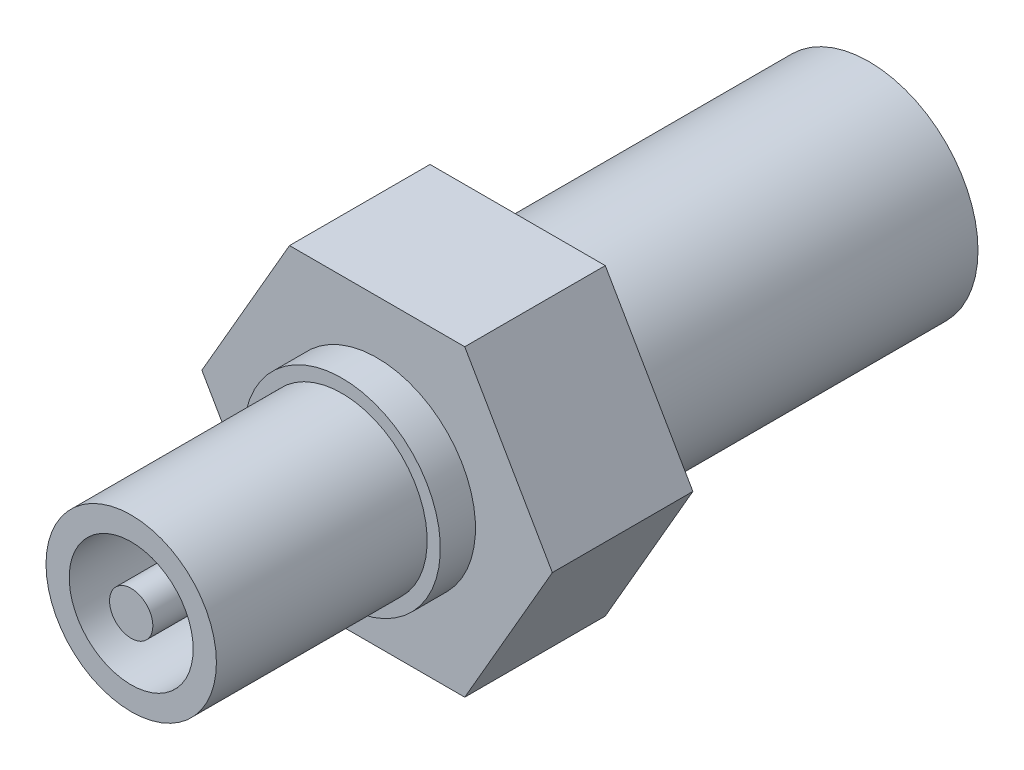
ISO-10303-21;
HEADER;
FILE_DESCRIPTION(('STEP AP214'),'2;1');
FILE_NAME('part.step','',(''),(''),'','','');
FILE_SCHEMA(('AUTOMOTIVE_DESIGN { 1 0 10303 214 1 1 1 1 }'));
ENDSEC;
DATA;
#1=APPLICATION_CONTEXT('core data for automotive mechanical design processes');
#2=APPLICATION_PROTOCOL_DEFINITION('international standard','automotive_design',2000,#1);
#3=PRODUCT_CONTEXT('',#1,'mechanical');
#4=PRODUCT('Part','Part','',(#3));
#5=PRODUCT_RELATED_PRODUCT_CATEGORY('part','',(#4));
#6=PRODUCT_DEFINITION_FORMATION('','',#4);
#7=PRODUCT_DEFINITION_CONTEXT('part definition',#1,'design');
#8=PRODUCT_DEFINITION('design','',#6,#7);
#9=PRODUCT_DEFINITION_SHAPE('','',#8);
#10=(LENGTH_UNIT() NAMED_UNIT(*) SI_UNIT(.MILLI.,.METRE.));
#11=(NAMED_UNIT(*) PLANE_ANGLE_UNIT() SI_UNIT($,.RADIAN.));
#12=(NAMED_UNIT(*) SI_UNIT($,.STERADIAN.) SOLID_ANGLE_UNIT());
#13=UNCERTAINTY_MEASURE_WITH_UNIT(LENGTH_MEASURE(1.E-05),#10,'distance_accuracy_value','');
#14=(GEOMETRIC_REPRESENTATION_CONTEXT(3) GLOBAL_UNCERTAINTY_ASSIGNED_CONTEXT((#13)) GLOBAL_UNIT_ASSIGNED_CONTEXT((#10,
#11,#12)) REPRESENTATION_CONTEXT('',''));
#15=CARTESIAN_POINT('',(0.,0.,0.));
#16=DIRECTION('',(0.,0.,1.));
#17=DIRECTION('',(1.,0.,0.));
#18=AXIS2_PLACEMENT_3D('',#15,#16,#17);
#19=CARTESIAN_POINT('',(3.95946814610245,6.858,-7.9375));
#20=DIRECTION('',(0.,0.,1.));
#21=DIRECTION('',(1.,0.,0.));
#22=AXIS2_PLACEMENT_3D('',#19,#20,#21);
#23=PLANE('',#22);
#24=DIRECTION('',(0.5,-0.866025403784439,0.));
#25=VECTOR('',#24,1.);
#26=CARTESIAN_POINT('',(7.91893629220491,0.,-7.9375));
#27=LINE('',#26,#25);
#28=CARTESIAN_POINT('',(3.95946814610245,6.858,-7.9375));
#29=VERTEX_POINT('',#28);
#30=CARTESIAN_POINT('',(7.91893629220491,0.,-7.9375));
#31=VERTEX_POINT('',#30);
#32=EDGE_CURVE('E128',#29,#31,#27,.T.);
#33=ORIENTED_EDGE('',*,*,#32,.T.);
#34=DIRECTION('',(-0.5,-0.866025403784439,0.));
#35=VECTOR('',#34,1.);
#36=CARTESIAN_POINT('',(3.95946814610245,-6.858,-7.9375));
#37=LINE('',#36,#35);
#38=CARTESIAN_POINT('',(3.95946814610245,-6.858,-7.9375));
#39=VERTEX_POINT('',#38);
#40=EDGE_CURVE('E105',#31,#39,#37,.T.);
#41=ORIENTED_EDGE('',*,*,#40,.T.);
#42=DIRECTION('',(-1.,0.,0.));
#43=VECTOR('',#42,1.);
#44=CARTESIAN_POINT('',(-3.95946814610245,-6.858,-7.9375));
#45=LINE('',#44,#43);
#46=CARTESIAN_POINT('',(-3.95946814610245,-6.858,-7.9375));
#47=VERTEX_POINT('',#46);
#48=EDGE_CURVE('E131',#39,#47,#45,.T.);
#49=ORIENTED_EDGE('',*,*,#48,.T.);
#50=DIRECTION('',(-0.5,0.866025403784439,0.));
#51=VECTOR('',#50,1.);
#52=CARTESIAN_POINT('',(-7.91893629220491,0.,-7.9375));
#53=LINE('',#52,#51);
#54=CARTESIAN_POINT('',(-7.91893629220491,0.,-7.9375));
#55=VERTEX_POINT('',#54);
#56=EDGE_CURVE('E133',#47,#55,#53,.T.);
#57=ORIENTED_EDGE('',*,*,#56,.T.);
#58=DIRECTION('',(0.5,0.866025403784439,0.));
#59=VECTOR('',#58,1.);
#60=CARTESIAN_POINT('',(-3.95946814610246,6.858,-7.9375));
#61=LINE('',#60,#59);
#62=CARTESIAN_POINT('',(-3.95946814610246,6.858,-7.9375));
#63=VERTEX_POINT('',#62);
#64=EDGE_CURVE('E56',#55,#63,#61,.T.);
#65=ORIENTED_EDGE('',*,*,#64,.T.);
#66=DIRECTION('',(1.,0.,0.));
#67=VECTOR('',#66,1.);
#68=CARTESIAN_POINT('',(3.95946814610245,6.858,-7.9375));
#69=LINE('',#68,#67);
#70=EDGE_CURVE('E51',#63,#29,#69,.T.);
#71=ORIENTED_EDGE('',*,*,#70,.T.);
#72=EDGE_LOOP('',(#33,#41,#49,#57,#65,#71));
#73=FACE_BOUND('',#72,.T.);
#74=CARTESIAN_POINT('',(0.,0.,-7.9375));
#75=DIRECTION('',(0.,0.,1.));
#76=DIRECTION('',(1.,0.,0.));
#77=AXIS2_PLACEMENT_3D('',#74,#75,#76);
#78=CIRCLE('',#77,4.9276);
#79=CARTESIAN_POINT('',(4.9276,0.,-7.9375));
#80=VERTEX_POINT('',#79);
#81=EDGE_CURVE('E11',#80,#80,#78,.F.);
#82=ORIENTED_EDGE('',*,*,#81,.F.);
#83=EDGE_LOOP('',(#82));
#84=FACE_BOUND('',#83,.T.);
#85=ADVANCED_FACE('F36',(#73,#84),#23,.F.);
#86=CARTESIAN_POINT('',(0.,0.,9.525));
#87=DIRECTION('',(0.,0.,-1.));
#88=DIRECTION('',(-1.,0.,0.));
#89=AXIS2_PLACEMENT_3D('',#86,#87,#88);
#90=CYLINDRICAL_SURFACE('',#89,3.85);
#91=CARTESIAN_POINT('',(0.,0.,9.525));
#92=DIRECTION('',(0.,0.,1.));
#93=DIRECTION('',(1.,0.,0.));
#94=AXIS2_PLACEMENT_3D('',#91,#92,#93);
#95=CIRCLE('',#94,3.85);
#96=CARTESIAN_POINT('',(3.85,0.,9.525));
#97=VERTEX_POINT('',#96);
#98=EDGE_CURVE('E44',#97,#97,#95,.T.);
#99=ORIENTED_EDGE('',*,*,#98,.F.);
#100=EDGE_LOOP('',(#99));
#101=FACE_BOUND('',#100,.T.);
#102=CARTESIAN_POINT('',(0.,0.,0.));
#103=DIRECTION('',(0.,0.,-1.));
#104=DIRECTION('',(-1.,0.,0.));
#105=AXIS2_PLACEMENT_3D('',#102,#103,#104);
#106=CIRCLE('',#105,3.85);
#107=CARTESIAN_POINT('',(-3.85,0.,0.));
#108=VERTEX_POINT('',#107);
#109=EDGE_CURVE('E153',#108,#108,#106,.T.);
#110=ORIENTED_EDGE('',*,*,#109,.F.);
#111=EDGE_LOOP('',(#110));
#112=FACE_BOUND('',#111,.T.);
#113=ADVANCED_FACE('F38',(#101,#112),#90,.T.);
#114=CARTESIAN_POINT('',(0.,0.,9.525));
#115=DIRECTION('',(0.,0.,1.));
#116=DIRECTION('',(1.,0.,0.));
#117=AXIS2_PLACEMENT_3D('',#114,#115,#116);
#118=PLANE('',#117);
#119=CARTESIAN_POINT('',(0.,0.,9.525));
#120=DIRECTION('',(0.,0.,1.));
#121=DIRECTION('',(1.,0.,0.));
#122=AXIS2_PLACEMENT_3D('',#119,#120,#121);
#123=CIRCLE('',#122,2.80042077962707);
#124=CARTESIAN_POINT('',(2.80042077962707,0.,9.525));
#125=VERTEX_POINT('',#124);
#126=EDGE_CURVE('E341',#125,#125,#123,.T.);
#127=ORIENTED_EDGE('',*,*,#126,.F.);
#128=EDGE_LOOP('',(#127));
#129=FACE_BOUND('',#128,.T.);
#130=ORIENTED_EDGE('',*,*,#98,.T.);
#131=EDGE_LOOP('',(#130));
#132=FACE_BOUND('',#131,.T.);
#133=ADVANCED_FACE('F158',(#129,#132),#118,.T.);
#134=CARTESIAN_POINT('',(0.,0.,0.));
#135=DIRECTION('',(0.,0.,-1.));
#136=DIRECTION('',(-1.,0.,0.));
#137=AXIS2_PLACEMENT_3D('',#134,#135,#136);
#138=PLANE('',#137);
#139=CARTESIAN_POINT('',(0.,0.,0.));
#140=DIRECTION('',(0.,0.,-1.));
#141=DIRECTION('',(-1.,0.,0.));
#142=AXIS2_PLACEMENT_3D('',#139,#140,#141);
#143=CIRCLE('',#142,4.445);
#144=CARTESIAN_POINT('',(-4.445,0.,0.));
#145=VERTEX_POINT('',#144);
#146=EDGE_CURVE('E108',#145,#145,#143,.T.);
#147=ORIENTED_EDGE('',*,*,#146,.F.);
#148=EDGE_LOOP('',(#147));
#149=FACE_BOUND('',#148,.T.);
#150=ORIENTED_EDGE('',*,*,#109,.T.);
#151=EDGE_LOOP('',(#150));
#152=FACE_BOUND('',#151,.T.);
#153=ADVANCED_FACE('F164',(#149,#152),#138,.F.);
#154=CARTESIAN_POINT('',(0.,0.,-1.5875));
#155=DIRECTION('',(0.,0.,1.));
#156=DIRECTION('',(1.,0.,0.));
#157=AXIS2_PLACEMENT_3D('',#154,#155,#156);
#158=CYLINDRICAL_SURFACE('',#157,4.445);
#159=CARTESIAN_POINT('',(0.,0.,-1.5875));
#160=DIRECTION('',(0.,0.,-1.));
#161=DIRECTION('',(-1.,0.,0.));
#162=AXIS2_PLACEMENT_3D('',#159,#160,#161);
#163=CIRCLE('',#162,4.445);
#164=CARTESIAN_POINT('',(-4.445,0.,-1.5875));
#165=VERTEX_POINT('',#164);
#166=EDGE_CURVE('E150',#165,#165,#163,.T.);
#167=ORIENTED_EDGE('',*,*,#166,.F.);
#168=EDGE_LOOP('',(#167));
#169=FACE_BOUND('',#168,.T.);
#170=ORIENTED_EDGE('',*,*,#146,.T.);
#171=EDGE_LOOP('',(#170));
#172=FACE_BOUND('',#171,.T.);
#173=ADVANCED_FACE('F166',(#169,#172),#158,.T.);
#174=CARTESIAN_POINT('',(3.95946814610245,6.858,-1.5875));
#175=DIRECTION('',(0.,0.,1.));
#176=DIRECTION('',(1.,0.,0.));
#177=AXIS2_PLACEMENT_3D('',#174,#175,#176);
#178=PLANE('',#177);
#179=DIRECTION('',(0.5,-0.866025403784439,0.));
#180=VECTOR('',#179,1.);
#181=CARTESIAN_POINT('',(7.91893629220491,0.,-1.5875));
#182=LINE('',#181,#180);
#183=CARTESIAN_POINT('',(3.95946814610245,6.858,-1.5875));
#184=VERTEX_POINT('',#183);
#185=CARTESIAN_POINT('',(7.91893629220491,0.,-1.5875));
#186=VERTEX_POINT('',#185);
#187=EDGE_CURVE('E95',#184,#186,#182,.T.);
#188=ORIENTED_EDGE('',*,*,#187,.F.);
#189=DIRECTION('',(1.,0.,0.));
#190=VECTOR('',#189,1.);
#191=CARTESIAN_POINT('',(3.95946814610245,6.858,-1.5875));
#192=LINE('',#191,#190);
#193=CARTESIAN_POINT('',(-3.95946814610246,6.858,-1.5875));
#194=VERTEX_POINT('',#193);
#195=EDGE_CURVE('E126',#194,#184,#192,.T.);
#196=ORIENTED_EDGE('',*,*,#195,.F.);
#197=DIRECTION('',(0.5,0.866025403784439,0.));
#198=VECTOR('',#197,1.);
#199=CARTESIAN_POINT('',(-3.95946814610246,6.858,-1.5875));
#200=LINE('',#199,#198);
#201=CARTESIAN_POINT('',(-7.91893629220491,0.,-1.5875));
#202=VERTEX_POINT('',#201);
#203=EDGE_CURVE('E124',#202,#194,#200,.T.);
#204=ORIENTED_EDGE('',*,*,#203,.F.);
#205=DIRECTION('',(-0.5,0.866025403784439,0.));
#206=VECTOR('',#205,1.);
#207=CARTESIAN_POINT('',(-7.91893629220491,0.,-1.5875));
#208=LINE('',#207,#206);
#209=CARTESIAN_POINT('',(-3.95946814610245,-6.858,-1.5875));
#210=VERTEX_POINT('',#209);
#211=EDGE_CURVE('E122',#210,#202,#208,.T.);
#212=ORIENTED_EDGE('',*,*,#211,.F.);
#213=DIRECTION('',(-1.,0.,0.));
#214=VECTOR('',#213,1.);
#215=CARTESIAN_POINT('',(-3.95946814610245,-6.858,-1.5875));
#216=LINE('',#215,#214);
#217=CARTESIAN_POINT('',(3.95946814610245,-6.858,-1.5875));
#218=VERTEX_POINT('',#217);
#219=EDGE_CURVE('E97',#218,#210,#216,.T.);
#220=ORIENTED_EDGE('',*,*,#219,.F.);
#221=DIRECTION('',(-0.5,-0.866025403784439,0.));
#222=VECTOR('',#221,1.);
#223=CARTESIAN_POINT('',(3.95946814610245,-6.858,-1.5875));
#224=LINE('',#223,#222);
#225=EDGE_CURVE('E89',#186,#218,#224,.T.);
#226=ORIENTED_EDGE('',*,*,#225,.F.);
#227=EDGE_LOOP('',(#188,#196,#204,#212,#220,#226));
#228=FACE_BOUND('',#227,.T.);
#229=ORIENTED_EDGE('',*,*,#166,.T.);
#230=EDGE_LOOP('',(#229));
#231=FACE_BOUND('',#230,.T.);
#232=ADVANCED_FACE('F91',(#228,#231),#178,.T.);
#233=CARTESIAN_POINT('',(7.91893629220491,0.,-7.9375));
#234=DIRECTION('',(-0.866025403784439,-0.5,0.));
#235=DIRECTION('',(0.5,-0.866025403784439,0.));
#236=AXIS2_PLACEMENT_3D('',#233,#234,#235);
#237=PLANE('',#236);
#238=ORIENTED_EDGE('',*,*,#187,.T.);
#239=DIRECTION('',(0.,0.,1.));
#240=VECTOR('',#239,1.);
#241=CARTESIAN_POINT('',(7.91893629220491,0.,-7.9375));
#242=LINE('',#241,#240);
#243=EDGE_CURVE('E103',#31,#186,#242,.T.);
#244=ORIENTED_EDGE('',*,*,#243,.F.);
#245=ORIENTED_EDGE('',*,*,#32,.F.);
#246=DIRECTION('',(0.,0.,1.));
#247=VECTOR('',#246,1.);
#248=CARTESIAN_POINT('',(3.95946814610245,6.858,-7.9375));
#249=LINE('',#248,#247);
#250=EDGE_CURVE('E113',#29,#184,#249,.T.);
#251=ORIENTED_EDGE('',*,*,#250,.T.);
#252=EDGE_LOOP('',(#238,#244,#245,#251));
#253=FACE_BOUND('',#252,.T.);
#254=ADVANCED_FACE('F112',(#253),#237,.F.);
#255=CARTESIAN_POINT('',(3.95946814610245,-6.858,-7.9375));
#256=DIRECTION('',(-0.866025403784439,0.5,0.));
#257=DIRECTION('',(-0.5,-0.866025403784439,0.));
#258=AXIS2_PLACEMENT_3D('',#255,#256,#257);
#259=PLANE('',#258);
#260=ORIENTED_EDGE('',*,*,#225,.T.);
#261=DIRECTION('',(0.,0.,1.));
#262=VECTOR('',#261,1.);
#263=CARTESIAN_POINT('',(3.95946814610245,-6.858,-7.9375));
#264=LINE('',#263,#262);
#265=EDGE_CURVE('E109',#39,#218,#264,.T.);
#266=ORIENTED_EDGE('',*,*,#265,.F.);
#267=ORIENTED_EDGE('',*,*,#40,.F.);
#268=ORIENTED_EDGE('',*,*,#243,.T.);
#269=EDGE_LOOP('',(#260,#266,#267,#268));
#270=FACE_BOUND('',#269,.T.);
#271=ADVANCED_FACE('F104',(#270),#259,.F.);
#272=CARTESIAN_POINT('',(-3.95946814610245,-6.858,-7.9375));
#273=DIRECTION('',(0.,1.,0.));
#274=DIRECTION('',(0.,0.,1.));
#275=AXIS2_PLACEMENT_3D('',#272,#273,#274);
#276=PLANE('',#275);
#277=ORIENTED_EDGE('',*,*,#219,.T.);
#278=DIRECTION('',(0.,0.,1.));
#279=VECTOR('',#278,1.);
#280=CARTESIAN_POINT('',(-3.95946814610245,-6.858,-7.9375));
#281=LINE('',#280,#279);
#282=EDGE_CURVE('E144',#47,#210,#281,.T.);
#283=ORIENTED_EDGE('',*,*,#282,.F.);
#284=ORIENTED_EDGE('',*,*,#48,.F.);
#285=ORIENTED_EDGE('',*,*,#265,.T.);
#286=EDGE_LOOP('',(#277,#283,#284,#285));
#287=FACE_BOUND('',#286,.T.);
#288=ADVANCED_FACE('F199',(#287),#276,.F.);
#289=CARTESIAN_POINT('',(-7.91893629220491,0.,-7.9375));
#290=DIRECTION('',(0.866025403784439,0.5,0.));
#291=DIRECTION('',(-0.5,0.866025403784439,0.));
#292=AXIS2_PLACEMENT_3D('',#289,#290,#291);
#293=PLANE('',#292);
#294=ORIENTED_EDGE('',*,*,#211,.T.);
#295=DIRECTION('',(0.,0.,1.));
#296=VECTOR('',#295,1.);
#297=CARTESIAN_POINT('',(-7.91893629220491,0.,-7.9375));
#298=LINE('',#297,#296);
#299=EDGE_CURVE('E141',#55,#202,#298,.T.);
#300=ORIENTED_EDGE('',*,*,#299,.F.);
#301=ORIENTED_EDGE('',*,*,#56,.F.);
#302=ORIENTED_EDGE('',*,*,#282,.T.);
#303=EDGE_LOOP('',(#294,#300,#301,#302));
#304=FACE_BOUND('',#303,.T.);
#305=ADVANCED_FACE('F195',(#304),#293,.F.);
#306=CARTESIAN_POINT('',(-3.95946814610246,6.858,-7.9375));
#307=DIRECTION('',(0.866025403784439,-0.5,0.));
#308=DIRECTION('',(0.5,0.866025403784439,0.));
#309=AXIS2_PLACEMENT_3D('',#306,#307,#308);
#310=PLANE('',#309);
#311=ORIENTED_EDGE('',*,*,#203,.T.);
#312=DIRECTION('',(0.,0.,1.));
#313=VECTOR('',#312,1.);
#314=CARTESIAN_POINT('',(-3.95946814610246,6.858,-7.9375));
#315=LINE('',#314,#313);
#316=EDGE_CURVE('E138',#63,#194,#315,.T.);
#317=ORIENTED_EDGE('',*,*,#316,.F.);
#318=ORIENTED_EDGE('',*,*,#64,.F.);
#319=ORIENTED_EDGE('',*,*,#299,.T.);
#320=EDGE_LOOP('',(#311,#317,#318,#319));
#321=FACE_BOUND('',#320,.T.);
#322=ADVANCED_FACE('F191',(#321),#310,.F.);
#323=CARTESIAN_POINT('',(3.95946814610245,6.858,-7.9375));
#324=DIRECTION('',(0.,-1.,0.));
#325=DIRECTION('',(0.,0.,-1.));
#326=AXIS2_PLACEMENT_3D('',#323,#324,#325);
#327=PLANE('',#326);
#328=ORIENTED_EDGE('',*,*,#195,.T.);
#329=ORIENTED_EDGE('',*,*,#250,.F.);
#330=ORIENTED_EDGE('',*,*,#70,.F.);
#331=ORIENTED_EDGE('',*,*,#316,.T.);
#332=EDGE_LOOP('',(#328,#329,#330,#331));
#333=FACE_BOUND('',#332,.T.);
#334=ADVANCED_FACE('F187',(#333),#327,.F.);
#335=CARTESIAN_POINT('',(0.,0.,-23.8125));
#336=DIRECTION('',(0.,0.,1.));
#337=DIRECTION('',(1.,0.,0.));
#338=AXIS2_PLACEMENT_3D('',#335,#336,#337);
#339=CYLINDRICAL_SURFACE('',#338,4.9276);
#340=CARTESIAN_POINT('',(0.,0.,-23.8125));
#341=DIRECTION('',(0.,0.,-1.));
#342=DIRECTION('',(-1.,0.,0.));
#343=AXIS2_PLACEMENT_3D('',#340,#341,#342);
#344=CIRCLE('',#343,4.9276);
#345=CARTESIAN_POINT('',(-4.9276,0.,-23.8125));
#346=VERTEX_POINT('',#345);
#347=EDGE_CURVE('E114',#346,#346,#344,.T.);
#348=ORIENTED_EDGE('',*,*,#347,.F.);
#349=EDGE_LOOP('',(#348));
#350=FACE_BOUND('',#349,.T.);
#351=ORIENTED_EDGE('',*,*,#81,.T.);
#352=EDGE_LOOP('',(#351));
#353=FACE_BOUND('',#352,.T.);
#354=ADVANCED_FACE('F190',(#350,#353),#339,.T.);
#355=CARTESIAN_POINT('',(0.,0.,-23.8125));
#356=DIRECTION('',(0.,0.,-1.));
#357=DIRECTION('',(-1.,0.,0.));
#358=AXIS2_PLACEMENT_3D('',#355,#356,#357);
#359=PLANE('',#358);
#360=ORIENTED_EDGE('',*,*,#347,.T.);
#361=EDGE_LOOP('',(#360));
#362=FACE_BOUND('',#361,.T.);
#363=ADVANCED_FACE('F237',(#362),#359,.T.);
#364=CARTESIAN_POINT('',(0.,0.,0.));
#365=DIRECTION('',(0.,0.,1.));
#366=DIRECTION('',(1.,0.,0.));
#367=AXIS2_PLACEMENT_3D('',#364,#365,#366);
#368=CYLINDRICAL_SURFACE('',#367,2.80042077962707);
#369=CARTESIAN_POINT('',(0.,0.,0.));
#370=DIRECTION('',(0.,0.,1.));
#371=DIRECTION('',(1.,0.,0.));
#372=AXIS2_PLACEMENT_3D('',#369,#370,#371);
#373=CIRCLE('',#372,2.80042077962707);
#374=CARTESIAN_POINT('',(2.80042077962707,0.,0.));
#375=VERTEX_POINT('',#374);
#376=EDGE_CURVE('E117',#375,#375,#373,.T.);
#377=ORIENTED_EDGE('',*,*,#376,.F.);
#378=EDGE_LOOP('',(#377));
#379=FACE_BOUND('',#378,.T.);
#380=ORIENTED_EDGE('',*,*,#126,.T.);
#381=EDGE_LOOP('',(#380));
#382=FACE_BOUND('',#381,.T.);
#383=ADVANCED_FACE('F242',(#379,#382),#368,.F.);
#384=CARTESIAN_POINT('',(0.,0.,0.));
#385=DIRECTION('',(0.,0.,1.));
#386=DIRECTION('',(1.,0.,0.));
#387=AXIS2_PLACEMENT_3D('',#384,#385,#386);
#388=PLANE('',#387);
#389=CARTESIAN_POINT('',(0.,0.,0.));
#390=DIRECTION('',(0.,0.,1.));
#391=DIRECTION('',(1.,0.,0.));
#392=AXIS2_PLACEMENT_3D('',#389,#390,#391);
#393=CIRCLE('',#392,0.97787641963701);
#394=CARTESIAN_POINT('',(0.97787641963701,0.,0.));
#395=VERTEX_POINT('',#394);
#396=EDGE_CURVE('E338',#395,#395,#393,.T.);
#397=ORIENTED_EDGE('',*,*,#396,.F.);
#398=EDGE_LOOP('',(#397));
#399=FACE_BOUND('',#398,.T.);
#400=ORIENTED_EDGE('',*,*,#376,.T.);
#401=EDGE_LOOP('',(#400));
#402=FACE_BOUND('',#401,.T.);
#403=ADVANCED_FACE('F247',(#399,#402),#388,.T.);
#404=CARTESIAN_POINT('',(0.,0.,0.));
#405=DIRECTION('',(0.,0.,1.));
#406=DIRECTION('',(1.,0.,0.));
#407=AXIS2_PLACEMENT_3D('',#404,#405,#406);
#408=CYLINDRICAL_SURFACE('',#407,0.97787641963701);
#409=ORIENTED_EDGE('',*,*,#396,.T.);
#410=EDGE_LOOP('',(#409));
#411=FACE_BOUND('',#410,.T.);
#412=CARTESIAN_POINT('',(0.,0.,9.525));
#413=DIRECTION('',(0.,0.,1.));
#414=DIRECTION('',(1.,0.,0.));
#415=AXIS2_PLACEMENT_3D('',#412,#413,#414);
#416=CIRCLE('',#415,0.97787641963701);
#417=CARTESIAN_POINT('',(0.97787641963701,0.,9.525));
#418=VERTEX_POINT('',#417);
#419=EDGE_CURVE('E336',#418,#418,#416,.T.);
#420=ORIENTED_EDGE('',*,*,#419,.F.);
#421=EDGE_LOOP('',(#420));
#422=FACE_BOUND('',#421,.T.);
#423=ADVANCED_FACE('F258',(#411,#422),#408,.T.);
#424=ORIENTED_EDGE('',*,*,#419,.T.);
#425=EDGE_LOOP('',(#424));
#426=FACE_BOUND('',#425,.T.);
#427=ADVANCED_FACE('F176',(#426),#118,.T.);
#428=CLOSED_SHELL('',(#85,#113,#133,#153,#173,#232,#254,#271,#288,#305,#322,#334,#354,#363,#383,
#403,#423,#427));
#429=MANIFOLD_SOLID_BREP('B2',#428);
#430=ADVANCED_BREP_SHAPE_REPRESENTATION('',(#18,#429),#14);
#431=SHAPE_DEFINITION_REPRESENTATION(#9,#430);
ENDSEC;
END-ISO-10303-21;
